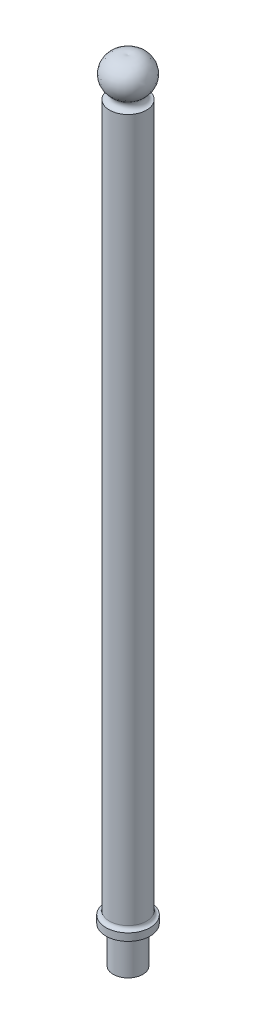
ISO-10303-21;
HEADER;
FILE_DESCRIPTION(('STEP AP214'),'2;1');
FILE_NAME('part.step','',(''),(''),'','','');
FILE_SCHEMA(('AUTOMOTIVE_DESIGN { 1 0 10303 214 1 1 1 1 }'));
ENDSEC;
DATA;
#1=APPLICATION_CONTEXT('core data for automotive mechanical design processes');
#2=APPLICATION_PROTOCOL_DEFINITION('international standard','automotive_design',2000,#1);
#3=PRODUCT_CONTEXT('',#1,'mechanical');
#4=PRODUCT('Part','Part','',(#3));
#5=PRODUCT_RELATED_PRODUCT_CATEGORY('part','',(#4));
#6=PRODUCT_DEFINITION_FORMATION('','',#4);
#7=PRODUCT_DEFINITION_CONTEXT('part definition',#1,'design');
#8=PRODUCT_DEFINITION('design','',#6,#7);
#9=PRODUCT_DEFINITION_SHAPE('','',#8);
#10=(LENGTH_UNIT() NAMED_UNIT(*) SI_UNIT(.MILLI.,.METRE.));
#11=(NAMED_UNIT(*) PLANE_ANGLE_UNIT() SI_UNIT($,.RADIAN.));
#12=(NAMED_UNIT(*) SI_UNIT($,.STERADIAN.) SOLID_ANGLE_UNIT());
#13=UNCERTAINTY_MEASURE_WITH_UNIT(LENGTH_MEASURE(1.E-05),#10,'distance_accuracy_value','');
#14=(GEOMETRIC_REPRESENTATION_CONTEXT(3) GLOBAL_UNCERTAINTY_ASSIGNED_CONTEXT((#13)) GLOBAL_UNIT_ASSIGNED_CONTEXT((#10,
#11,#12)) REPRESENTATION_CONTEXT('',''));
#15=CARTESIAN_POINT('',(0.,0.,0.));
#16=DIRECTION('',(0.,0.,1.));
#17=DIRECTION('',(1.,0.,0.));
#18=AXIS2_PLACEMENT_3D('',#15,#16,#17);
#19=CARTESIAN_POINT('',(-6.,0.,0.));
#20=DIRECTION('',(0.,1.,0.));
#21=DIRECTION('',(0.,0.,1.));
#22=AXIS2_PLACEMENT_3D('',#19,#20,#21);
#23=PLANE('',#22);
#24=CARTESIAN_POINT('',(0.,0.,0.));
#25=DIRECTION('',(0.,-1.,0.));
#26=DIRECTION('',(0.,0.,-1.));
#27=AXIS2_PLACEMENT_3D('',#24,#25,#26);
#28=CIRCLE('',#27,6.);
#29=CARTESIAN_POINT('',(0.,0.,-6.));
#30=VERTEX_POINT('',#29);
#31=EDGE_CURVE('E11',#30,#30,#28,.T.);
#32=ORIENTED_EDGE('',*,*,#31,.T.);
#33=EDGE_LOOP('',(#32));
#34=FACE_BOUND('',#33,.T.);
#35=ADVANCED_FACE('F45',(#34),#23,.F.);
#36=CARTESIAN_POINT('',(0.,0.,0.));
#37=DIRECTION('',(0.,-1.,0.));
#38=DIRECTION('',(0.,0.,-1.));
#39=AXIS2_PLACEMENT_3D('',#36,#37,#38);
#40=CYLINDRICAL_SURFACE('',#39,6.);
#41=ORIENTED_EDGE('',*,*,#31,.F.);
#42=EDGE_LOOP('',(#41));
#43=FACE_BOUND('',#42,.T.);
#44=CARTESIAN_POINT('',(0.,15.,0.));
#45=DIRECTION('',(0.,-1.,0.));
#46=DIRECTION('',(0.,0.,-1.));
#47=AXIS2_PLACEMENT_3D('',#44,#45,#46);
#48=CIRCLE('',#47,6.);
#49=CARTESIAN_POINT('',(0.,15.,-6.));
#50=VERTEX_POINT('',#49);
#51=EDGE_CURVE('E51',#50,#50,#48,.T.);
#52=ORIENTED_EDGE('',*,*,#51,.T.);
#53=EDGE_LOOP('',(#52));
#54=FACE_BOUND('',#53,.T.);
#55=ADVANCED_FACE('F67',(#43,#54),#40,.T.);
#56=CARTESIAN_POINT('',(-6.,15.,0.));
#57=DIRECTION('',(0.,1.,0.));
#58=DIRECTION('',(0.,0.,1.));
#59=AXIS2_PLACEMENT_3D('',#56,#57,#58);
#60=PLANE('',#59);
#61=ORIENTED_EDGE('',*,*,#51,.F.);
#62=EDGE_LOOP('',(#61));
#63=FACE_BOUND('',#62,.T.);
#64=CARTESIAN_POINT('',(0.,15.,0.));
#65=DIRECTION('',(0.,-1.,0.));
#66=DIRECTION('',(0.,0.,-1.));
#67=AXIS2_PLACEMENT_3D('',#64,#65,#66);
#68=CIRCLE('',#67,9.);
#69=CARTESIAN_POINT('',(0.,15.,-9.));
#70=VERTEX_POINT('',#69);
#71=EDGE_CURVE('E79',#70,#70,#68,.T.);
#72=ORIENTED_EDGE('',*,*,#71,.T.);
#73=EDGE_LOOP('',(#72));
#74=FACE_BOUND('',#73,.T.);
#75=ADVANCED_FACE('F72',(#63,#74),#60,.F.);
#76=CARTESIAN_POINT('',(0.,0.,0.));
#77=DIRECTION('',(0.,-1.,0.));
#78=DIRECTION('',(0.,0.,-1.));
#79=AXIS2_PLACEMENT_3D('',#76,#77,#78);
#80=CYLINDRICAL_SURFACE('',#79,9.);
#81=ORIENTED_EDGE('',*,*,#71,.F.);
#82=EDGE_LOOP('',(#81));
#83=FACE_BOUND('',#82,.T.);
#84=CARTESIAN_POINT('',(0.,18.,0.));
#85=DIRECTION('',(0.,-1.,0.));
#86=DIRECTION('',(0.,0.,-1.));
#87=AXIS2_PLACEMENT_3D('',#84,#85,#86);
#88=CIRCLE('',#87,9.);
#89=CARTESIAN_POINT('',(0.,18.,-9.));
#90=VERTEX_POINT('',#89);
#91=EDGE_CURVE('E81',#90,#90,#88,.T.);
#92=ORIENTED_EDGE('',*,*,#91,.T.);
#93=EDGE_LOOP('',(#92));
#94=FACE_BOUND('',#93,.T.);
#95=ADVANCED_FACE('F104',(#83,#94),#80,.T.);
#96=CARTESIAN_POINT('',(0.,19.5,0.));
#97=DIRECTION('',(0.,-1.,0.));
#98=DIRECTION('',(0.,0.,-1.));
#99=AXIS2_PLACEMENT_3D('',#96,#97,#98);
#100=TOROIDAL_SURFACE('',#99,9.,1.5);
#101=ORIENTED_EDGE('',*,*,#91,.F.);
#102=EDGE_LOOP('',(#101));
#103=FACE_BOUND('',#102,.T.);
#104=CARTESIAN_POINT('',(0.,19.5,0.));
#105=DIRECTION('',(0.,-1.,0.));
#106=DIRECTION('',(0.,0.,-1.));
#107=AXIS2_PLACEMENT_3D('',#104,#105,#106);
#108=CIRCLE('',#107,7.5);
#109=CARTESIAN_POINT('',(0.,19.5,-7.5));
#110=VERTEX_POINT('',#109);
#111=EDGE_CURVE('E86',#110,#110,#108,.T.);
#112=ORIENTED_EDGE('',*,*,#111,.T.);
#113=EDGE_LOOP('',(#112));
#114=FACE_BOUND('',#113,.T.);
#115=ADVANCED_FACE('F98',(#103,#114),#100,.F.);
#116=CARTESIAN_POINT('',(0.,0.,0.));
#117=DIRECTION('',(0.,-1.,0.));
#118=DIRECTION('',(0.,0.,-1.));
#119=AXIS2_PLACEMENT_3D('',#116,#117,#118);
#120=CYLINDRICAL_SURFACE('',#119,7.5);
#121=ORIENTED_EDGE('',*,*,#111,.F.);
#122=EDGE_LOOP('',(#121));
#123=FACE_BOUND('',#122,.T.);
#124=CARTESIAN_POINT('',(0.,305.,0.));
#125=DIRECTION('',(0.,-1.,0.));
#126=DIRECTION('',(0.,0.,-1.));
#127=AXIS2_PLACEMENT_3D('',#124,#125,#126);
#128=CIRCLE('',#127,7.5);
#129=CARTESIAN_POINT('',(0.,305.,-7.5));
#130=VERTEX_POINT('',#129);
#131=EDGE_CURVE('E89',#130,#130,#128,.T.);
#132=ORIENTED_EDGE('',*,*,#131,.T.);
#133=EDGE_LOOP('',(#132));
#134=FACE_BOUND('',#133,.T.);
#135=ADVANCED_FACE('F62',(#123,#134),#120,.T.);
#136=CARTESIAN_POINT('',(0.,307.,0.));
#137=DIRECTION('',(0.,-1.,0.));
#138=DIRECTION('',(0.,0.,-1.));
#139=AXIS2_PLACEMENT_3D('',#136,#137,#138);
#140=TOROIDAL_SURFACE('',#139,7.5,2.00000000000001);
#141=ORIENTED_EDGE('',*,*,#131,.F.);
#142=EDGE_LOOP('',(#141));
#143=FACE_BOUND('',#142,.T.);
#144=CARTESIAN_POINT('',(0.,308.555555555556,0.));
#145=DIRECTION('',(0.,-1.,0.));
#146=DIRECTION('',(0.,0.,-1.));
#147=AXIS2_PLACEMENT_3D('',#144,#145,#146);
#148=CIRCLE('',#147,6.2429212778906);
#149=CARTESIAN_POINT('',(0.,308.555555555556,-6.2429212778906));
#150=VERTEX_POINT('',#149);
#151=EDGE_CURVE('E92',#150,#150,#148,.T.);
#152=ORIENTED_EDGE('',*,*,#151,.T.);
#153=EDGE_LOOP('',(#152));
#154=FACE_BOUND('',#153,.T.);
#155=ADVANCED_FACE('F56',(#143,#154),#140,.F.);
#156=CARTESIAN_POINT('',(0.,314.,-1.84314575050769));
#157=DIRECTION('',(-1.,0.,0.));
#158=DIRECTION('',(0.,0.,-1.));
#159=AXIS2_PLACEMENT_3D('',#156,#157,#158);
#160=CIRCLE('',#159,6.99999999999999);
#161=TRIMMED_CURVE('',#160,(PARAMETER_VALUE(-1.83724441879892)),
(PARAMETER_VALUE(1.83724441879892)),.T.,.PARAMETER.);
#162=CARTESIAN_POINT('',(0.,314.,0.));
#163=DIRECTION('',(0.,-1.,0.));
#164=AXIS1_PLACEMENT('',#162,#163);
#165=SURFACE_OF_REVOLUTION('',#161,#164);
#166=ORIENTED_EDGE('',*,*,#151,.F.);
#167=EDGE_LOOP('',(#166));
#168=FACE_BOUND('',#167,.T.);
#169=CARTESIAN_POINT('',(0.,320.752985542883,0.));
#170=VERTEX_POINT('',#169);
#171=VERTEX_LOOP('',#170);
#172=FACE_BOUND('',#171,.T.);
#173=ADVANCED_FACE('F54',(#168,#172),#165,.T.);
#174=CLOSED_SHELL('',(#35,#55,#75,#95,#115,#135,#155,#173));
#175=MANIFOLD_SOLID_BREP('B2',#174);
#176=ADVANCED_BREP_SHAPE_REPRESENTATION('',(#18,#175),#14);
#177=SHAPE_DEFINITION_REPRESENTATION(#9,#176);
ENDSEC;
END-ISO-10303-21;
